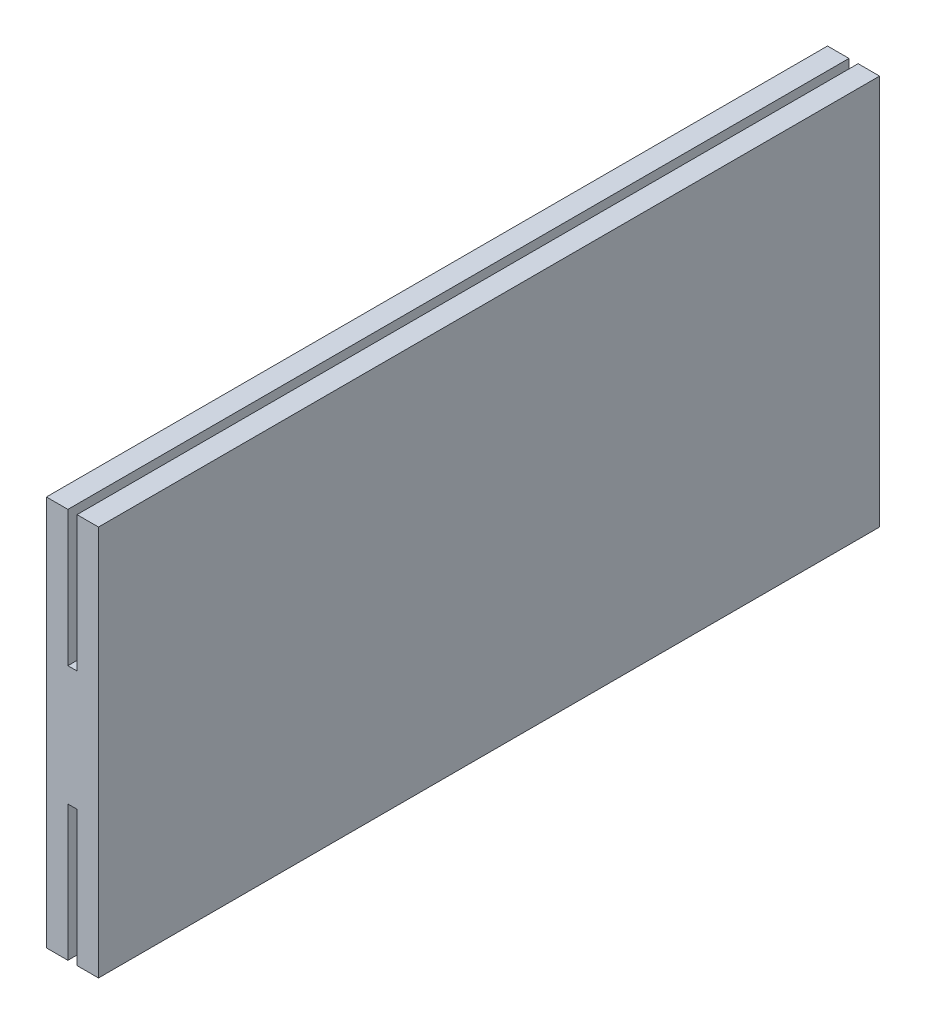
ISO-10303-21;
HEADER;
FILE_DESCRIPTION(('STEP AP214'),'2;1');
FILE_NAME('part.step','',(''),(''),'','','');
FILE_SCHEMA(('AUTOMOTIVE_DESIGN { 1 0 10303 214 1 1 1 1 }'));
ENDSEC;
DATA;
#1=APPLICATION_CONTEXT('core data for automotive mechanical design processes');
#2=APPLICATION_PROTOCOL_DEFINITION('international standard','automotive_design',2000,#1);
#3=PRODUCT_CONTEXT('',#1,'mechanical');
#4=PRODUCT('Part','Part','',(#3));
#5=PRODUCT_RELATED_PRODUCT_CATEGORY('part','',(#4));
#6=PRODUCT_DEFINITION_FORMATION('','',#4);
#7=PRODUCT_DEFINITION_CONTEXT('part definition',#1,'design');
#8=PRODUCT_DEFINITION('design','',#6,#7);
#9=PRODUCT_DEFINITION_SHAPE('','',#8);
#10=(LENGTH_UNIT() NAMED_UNIT(*) SI_UNIT(.MILLI.,.METRE.));
#11=(NAMED_UNIT(*) PLANE_ANGLE_UNIT() SI_UNIT($,.RADIAN.));
#12=(NAMED_UNIT(*) SI_UNIT($,.STERADIAN.) SOLID_ANGLE_UNIT());
#13=UNCERTAINTY_MEASURE_WITH_UNIT(LENGTH_MEASURE(1.E-05),#10,'distance_accuracy_value','');
#14=(GEOMETRIC_REPRESENTATION_CONTEXT(3) GLOBAL_UNCERTAINTY_ASSIGNED_CONTEXT((#13)) GLOBAL_UNIT_ASSIGNED_CONTEXT((#10,
#11,#12)) REPRESENTATION_CONTEXT('',''));
#15=CARTESIAN_POINT('',(0.,0.,0.));
#16=DIRECTION('',(0.,0.,1.));
#17=DIRECTION('',(1.,0.,0.));
#18=AXIS2_PLACEMENT_3D('',#15,#16,#17);
#19=CARTESIAN_POINT('',(0.,7.5,30.));
#20=DIRECTION('',(0.,1.,0.));
#21=DIRECTION('',(0.,0.,1.));
#22=AXIS2_PLACEMENT_3D('',#19,#20,#21);
#23=PLANE('',#22);
#24=DIRECTION('',(1.,0.,0.));
#25=VECTOR('',#24,1.);
#26=CARTESIAN_POINT('',(0.,7.5,0.));
#27=LINE('',#26,#25);
#28=CARTESIAN_POINT('',(0.174999999999999,7.5,0.));
#29=VERTEX_POINT('',#28);
#30=CARTESIAN_POINT('',(0.999999999999999,7.5,0.));
#31=VERTEX_POINT('',#30);
#32=EDGE_CURVE('E170',#29,#31,#27,.T.);
#33=ORIENTED_EDGE('',*,*,#32,.F.);
#34=DIRECTION('',(0.,0.,-1.));
#35=VECTOR('',#34,1.);
#36=CARTESIAN_POINT('',(0.174999999999999,7.5,30.));
#37=LINE('',#36,#35);
#38=CARTESIAN_POINT('',(0.174999999999999,7.5,30.));
#39=VERTEX_POINT('',#38);
#40=EDGE_CURVE('E11',#39,#29,#37,.T.);
#41=ORIENTED_EDGE('',*,*,#40,.F.);
#42=DIRECTION('',(1.,0.,0.));
#43=VECTOR('',#42,1.);
#44=CARTESIAN_POINT('',(0.,7.5,30.));
#45=LINE('',#44,#43);
#46=CARTESIAN_POINT('',(0.999999999999999,7.5,30.));
#47=VERTEX_POINT('',#46);
#48=EDGE_CURVE('E206',#39,#47,#45,.T.);
#49=ORIENTED_EDGE('',*,*,#48,.T.);
#50=DIRECTION('',(0.,0.,-1.));
#51=VECTOR('',#50,1.);
#52=CARTESIAN_POINT('',(0.999999999999999,7.5,30.));
#53=LINE('',#52,#51);
#54=EDGE_CURVE('E61',#47,#31,#53,.T.);
#55=ORIENTED_EDGE('',*,*,#54,.T.);
#56=EDGE_LOOP('',(#33,#41,#49,#55));
#57=FACE_BOUND('',#56,.T.);
#58=ADVANCED_FACE('F43',(#57),#23,.T.);
#59=CARTESIAN_POINT('',(0.175,0.,30.));
#60=DIRECTION('',(1.,0.,0.));
#61=DIRECTION('',(0.,1.,0.));
#62=AXIS2_PLACEMENT_3D('',#59,#60,#61);
#63=PLANE('',#62);
#64=DIRECTION('',(0.,-1.,0.));
#65=VECTOR('',#64,1.);
#66=CARTESIAN_POINT('',(0.175,0.,0.));
#67=LINE('',#66,#65);
#68=CARTESIAN_POINT('',(0.175,2.3,0.));
#69=VERTEX_POINT('',#68);
#70=EDGE_CURVE('E173',#29,#69,#67,.T.);
#71=ORIENTED_EDGE('',*,*,#70,.T.);
#72=DIRECTION('',(0.,0.,-1.));
#73=VECTOR('',#72,1.);
#74=CARTESIAN_POINT('',(0.175,2.3,30.));
#75=LINE('',#74,#73);
#76=CARTESIAN_POINT('',(0.175,2.3,30.));
#77=VERTEX_POINT('',#76);
#78=EDGE_CURVE('E53',#77,#69,#75,.T.);
#79=ORIENTED_EDGE('',*,*,#78,.F.);
#80=DIRECTION('',(0.,-1.,0.));
#81=VECTOR('',#80,1.);
#82=CARTESIAN_POINT('',(0.175,0.,30.));
#83=LINE('',#82,#81);
#84=EDGE_CURVE('E256',#39,#77,#83,.T.);
#85=ORIENTED_EDGE('',*,*,#84,.F.);
#86=ORIENTED_EDGE('',*,*,#40,.T.);
#87=EDGE_LOOP('',(#71,#79,#85,#86));
#88=FACE_BOUND('',#87,.T.);
#89=ADVANCED_FACE('F45',(#88),#63,.F.);
#90=CARTESIAN_POINT('',(0.,2.3,30.));
#91=DIRECTION('',(0.,1.,0.));
#92=DIRECTION('',(0.,0.,1.));
#93=AXIS2_PLACEMENT_3D('',#90,#91,#92);
#94=PLANE('',#93);
#95=DIRECTION('',(1.,0.,0.));
#96=VECTOR('',#95,1.);
#97=CARTESIAN_POINT('',(0.,2.3,0.));
#98=LINE('',#97,#96);
#99=CARTESIAN_POINT('',(-0.175,2.3,0.));
#100=VERTEX_POINT('',#99);
#101=EDGE_CURVE('E178',#100,#69,#98,.T.);
#102=ORIENTED_EDGE('',*,*,#101,.F.);
#103=DIRECTION('',(0.,0.,-1.));
#104=VECTOR('',#103,1.);
#105=CARTESIAN_POINT('',(-0.175,2.3,30.));
#106=LINE('',#105,#104);
#107=CARTESIAN_POINT('',(-0.175,2.3,30.));
#108=VERTEX_POINT('',#107);
#109=EDGE_CURVE('E231',#108,#100,#106,.T.);
#110=ORIENTED_EDGE('',*,*,#109,.F.);
#111=DIRECTION('',(1.,0.,0.));
#112=VECTOR('',#111,1.);
#113=CARTESIAN_POINT('',(0.,2.3,30.));
#114=LINE('',#113,#112);
#115=EDGE_CURVE('E240',#108,#77,#114,.T.);
#116=ORIENTED_EDGE('',*,*,#115,.T.);
#117=ORIENTED_EDGE('',*,*,#78,.T.);
#118=EDGE_LOOP('',(#102,#110,#116,#117));
#119=FACE_BOUND('',#118,.T.);
#120=ADVANCED_FACE('F238',(#119),#94,.T.);
#121=CARTESIAN_POINT('',(-0.175,0.,30.));
#122=DIRECTION('',(1.,0.,0.));
#123=DIRECTION('',(0.,1.,0.));
#124=AXIS2_PLACEMENT_3D('',#121,#122,#123);
#125=PLANE('',#124);
#126=DIRECTION('',(0.,-1.,0.));
#127=VECTOR('',#126,1.);
#128=CARTESIAN_POINT('',(-0.175,0.,0.));
#129=LINE('',#128,#127);
#130=CARTESIAN_POINT('',(-0.174999999999999,7.5,0.));
#131=VERTEX_POINT('',#130);
#132=EDGE_CURVE('E182',#131,#100,#129,.T.);
#133=ORIENTED_EDGE('',*,*,#132,.F.);
#134=DIRECTION('',(0.,0.,-1.));
#135=VECTOR('',#134,1.);
#136=CARTESIAN_POINT('',(-0.174999999999999,7.5,30.));
#137=LINE('',#136,#135);
#138=CARTESIAN_POINT('',(-0.174999999999999,7.5,30.));
#139=VERTEX_POINT('',#138);
#140=EDGE_CURVE('E228',#139,#131,#137,.T.);
#141=ORIENTED_EDGE('',*,*,#140,.F.);
#142=DIRECTION('',(0.,-1.,0.));
#143=VECTOR('',#142,1.);
#144=CARTESIAN_POINT('',(-0.175,0.,30.));
#145=LINE('',#144,#143);
#146=EDGE_CURVE('E253',#139,#108,#145,.T.);
#147=ORIENTED_EDGE('',*,*,#146,.T.);
#148=ORIENTED_EDGE('',*,*,#109,.T.);
#149=EDGE_LOOP('',(#133,#141,#147,#148));
#150=FACE_BOUND('',#149,.T.);
#151=ADVANCED_FACE('F250',(#150),#125,.T.);
#152=CARTESIAN_POINT('',(-1.,7.5,0.));
#153=VERTEX_POINT('',#152);
#154=EDGE_CURVE('E174',#153,#131,#27,.T.);
#155=ORIENTED_EDGE('',*,*,#154,.F.);
#156=DIRECTION('',(0.,0.,-1.));
#157=VECTOR('',#156,1.);
#158=CARTESIAN_POINT('',(-1.,7.5,30.));
#159=LINE('',#158,#157);
#160=CARTESIAN_POINT('',(-1.,7.5,30.));
#161=VERTEX_POINT('',#160);
#162=EDGE_CURVE('E225',#161,#153,#159,.T.);
#163=ORIENTED_EDGE('',*,*,#162,.F.);
#164=EDGE_CURVE('E261',#161,#139,#45,.T.);
#165=ORIENTED_EDGE('',*,*,#164,.T.);
#166=ORIENTED_EDGE('',*,*,#140,.T.);
#167=EDGE_LOOP('',(#155,#163,#165,#166));
#168=FACE_BOUND('',#167,.T.);
#169=ADVANCED_FACE('F285',(#168),#23,.T.);
#170=CARTESIAN_POINT('',(-1.,0.,30.));
#171=DIRECTION('',(1.,0.,0.));
#172=DIRECTION('',(0.,1.,0.));
#173=AXIS2_PLACEMENT_3D('',#170,#171,#172);
#174=PLANE('',#173);
#175=DIRECTION('',(0.,-1.,0.));
#176=VECTOR('',#175,1.);
#177=CARTESIAN_POINT('',(-1.,0.,0.));
#178=LINE('',#177,#176);
#179=CARTESIAN_POINT('',(-0.999999999999999,-7.5,0.));
#180=VERTEX_POINT('',#179);
#181=EDGE_CURVE('E186',#153,#180,#178,.T.);
#182=ORIENTED_EDGE('',*,*,#181,.T.);
#183=DIRECTION('',(0.,0.,-1.));
#184=VECTOR('',#183,1.);
#185=CARTESIAN_POINT('',(-0.999999999999999,-7.5,30.));
#186=LINE('',#185,#184);
#187=CARTESIAN_POINT('',(-0.999999999999999,-7.5,30.));
#188=VERTEX_POINT('',#187);
#189=EDGE_CURVE('E221',#188,#180,#186,.T.);
#190=ORIENTED_EDGE('',*,*,#189,.F.);
#191=DIRECTION('',(0.,-1.,0.));
#192=VECTOR('',#191,1.);
#193=CARTESIAN_POINT('',(-1.,0.,30.));
#194=LINE('',#193,#192);
#195=EDGE_CURVE('E266',#161,#188,#194,.T.);
#196=ORIENTED_EDGE('',*,*,#195,.F.);
#197=ORIENTED_EDGE('',*,*,#162,.T.);
#198=EDGE_LOOP('',(#182,#190,#196,#197));
#199=FACE_BOUND('',#198,.T.);
#200=ADVANCED_FACE('F289',(#199),#174,.F.);
#201=CARTESIAN_POINT('',(0.,-7.5,30.));
#202=DIRECTION('',(0.,1.,0.));
#203=DIRECTION('',(0.,0.,1.));
#204=AXIS2_PLACEMENT_3D('',#201,#202,#203);
#205=PLANE('',#204);
#206=DIRECTION('',(1.,0.,0.));
#207=VECTOR('',#206,1.);
#208=CARTESIAN_POINT('',(0.,-7.5,0.));
#209=LINE('',#208,#207);
#210=CARTESIAN_POINT('',(-0.175,-7.5,0.));
#211=VERTEX_POINT('',#210);
#212=EDGE_CURVE('E189',#180,#211,#209,.T.);
#213=ORIENTED_EDGE('',*,*,#212,.T.);
#214=DIRECTION('',(0.,0.,-1.));
#215=VECTOR('',#214,1.);
#216=CARTESIAN_POINT('',(-0.175,-7.5,30.));
#217=LINE('',#216,#215);
#218=CARTESIAN_POINT('',(-0.175,-7.5,30.));
#219=VERTEX_POINT('',#218);
#220=EDGE_CURVE('E217',#219,#211,#217,.T.);
#221=ORIENTED_EDGE('',*,*,#220,.F.);
#222=DIRECTION('',(1.,0.,0.));
#223=VECTOR('',#222,1.);
#224=CARTESIAN_POINT('',(0.,-7.5,30.));
#225=LINE('',#224,#223);
#226=EDGE_CURVE('E155',#188,#219,#225,.T.);
#227=ORIENTED_EDGE('',*,*,#226,.F.);
#228=ORIENTED_EDGE('',*,*,#189,.T.);
#229=EDGE_LOOP('',(#213,#221,#227,#228));
#230=FACE_BOUND('',#229,.T.);
#231=ADVANCED_FACE('F292',(#230),#205,.F.);
#232=CARTESIAN_POINT('',(-0.175,0.,30.));
#233=DIRECTION('',(-1.,0.,0.));
#234=DIRECTION('',(0.,0.,1.));
#235=AXIS2_PLACEMENT_3D('',#232,#233,#234);
#236=PLANE('',#235);
#237=DIRECTION('',(0.,1.,0.));
#238=VECTOR('',#237,1.);
#239=CARTESIAN_POINT('',(-0.175,0.,0.));
#240=LINE('',#239,#238);
#241=CARTESIAN_POINT('',(-0.175,-2.3,0.));
#242=VERTEX_POINT('',#241);
#243=EDGE_CURVE('E192',#211,#242,#240,.T.);
#244=ORIENTED_EDGE('',*,*,#243,.T.);
#245=DIRECTION('',(0.,0.,-1.));
#246=VECTOR('',#245,1.);
#247=CARTESIAN_POINT('',(-0.175,-2.3,30.));
#248=LINE('',#247,#246);
#249=CARTESIAN_POINT('',(-0.175,-2.3,30.));
#250=VERTEX_POINT('',#249);
#251=EDGE_CURVE('E213',#250,#242,#248,.T.);
#252=ORIENTED_EDGE('',*,*,#251,.F.);
#253=DIRECTION('',(0.,1.,0.));
#254=VECTOR('',#253,1.);
#255=CARTESIAN_POINT('',(-0.175,0.,30.));
#256=LINE('',#255,#254);
#257=EDGE_CURVE('E164',#219,#250,#256,.T.);
#258=ORIENTED_EDGE('',*,*,#257,.F.);
#259=ORIENTED_EDGE('',*,*,#220,.T.);
#260=EDGE_LOOP('',(#244,#252,#258,#259));
#261=FACE_BOUND('',#260,.T.);
#262=ADVANCED_FACE('F275',(#261),#236,.F.);
#263=CARTESIAN_POINT('',(0.,-2.3,30.));
#264=DIRECTION('',(0.,1.,0.));
#265=DIRECTION('',(0.,0.,1.));
#266=AXIS2_PLACEMENT_3D('',#263,#264,#265);
#267=PLANE('',#266);
#268=DIRECTION('',(1.,0.,0.));
#269=VECTOR('',#268,1.);
#270=CARTESIAN_POINT('',(0.,-2.3,0.));
#271=LINE('',#270,#269);
#272=CARTESIAN_POINT('',(0.175,-2.3,0.));
#273=VERTEX_POINT('',#272);
#274=EDGE_CURVE('E196',#242,#273,#271,.T.);
#275=ORIENTED_EDGE('',*,*,#274,.T.);
#276=DIRECTION('',(0.,0.,-1.));
#277=VECTOR('',#276,1.);
#278=CARTESIAN_POINT('',(0.175,-2.3,30.));
#279=LINE('',#278,#277);
#280=CARTESIAN_POINT('',(0.175,-2.3,30.));
#281=VERTEX_POINT('',#280);
#282=EDGE_CURVE('E146',#281,#273,#279,.T.);
#283=ORIENTED_EDGE('',*,*,#282,.F.);
#284=DIRECTION('',(1.,0.,0.));
#285=VECTOR('',#284,1.);
#286=CARTESIAN_POINT('',(0.,-2.3,30.));
#287=LINE('',#286,#285);
#288=EDGE_CURVE('E159',#250,#281,#287,.T.);
#289=ORIENTED_EDGE('',*,*,#288,.F.);
#290=ORIENTED_EDGE('',*,*,#251,.T.);
#291=EDGE_LOOP('',(#275,#283,#289,#290));
#292=FACE_BOUND('',#291,.T.);
#293=ADVANCED_FACE('F279',(#292),#267,.F.);
#294=CARTESIAN_POINT('',(0.175,0.,30.));
#295=DIRECTION('',(-1.,0.,0.));
#296=DIRECTION('',(0.,0.,1.));
#297=AXIS2_PLACEMENT_3D('',#294,#295,#296);
#298=PLANE('',#297);
#299=DIRECTION('',(0.,1.,0.));
#300=VECTOR('',#299,1.);
#301=CARTESIAN_POINT('',(0.175,0.,0.));
#302=LINE('',#301,#300);
#303=CARTESIAN_POINT('',(0.175,-7.5,0.));
#304=VERTEX_POINT('',#303);
#305=EDGE_CURVE('E142',#304,#273,#302,.T.);
#306=ORIENTED_EDGE('',*,*,#305,.F.);
#307=DIRECTION('',(0.,0.,-1.));
#308=VECTOR('',#307,1.);
#309=CARTESIAN_POINT('',(0.175,-7.5,30.));
#310=LINE('',#309,#308);
#311=CARTESIAN_POINT('',(0.175,-7.5,30.));
#312=VERTEX_POINT('',#311);
#313=EDGE_CURVE('E136',#312,#304,#310,.T.);
#314=ORIENTED_EDGE('',*,*,#313,.F.);
#315=DIRECTION('',(0.,1.,0.));
#316=VECTOR('',#315,1.);
#317=CARTESIAN_POINT('',(0.175,0.,30.));
#318=LINE('',#317,#316);
#319=EDGE_CURVE('E140',#312,#281,#318,.T.);
#320=ORIENTED_EDGE('',*,*,#319,.T.);
#321=ORIENTED_EDGE('',*,*,#282,.T.);
#322=EDGE_LOOP('',(#306,#314,#320,#321));
#323=FACE_BOUND('',#322,.T.);
#324=ADVANCED_FACE('F138',(#323),#298,.T.);
#325=CARTESIAN_POINT('',(1.,-7.5,0.));
#326=VERTEX_POINT('',#325);
#327=EDGE_CURVE('E193',#304,#326,#209,.T.);
#328=ORIENTED_EDGE('',*,*,#327,.T.);
#329=DIRECTION('',(0.,0.,-1.));
#330=VECTOR('',#329,1.);
#331=CARTESIAN_POINT('',(1.,-7.5,30.));
#332=LINE('',#331,#330);
#333=CARTESIAN_POINT('',(1.,-7.5,30.));
#334=VERTEX_POINT('',#333);
#335=EDGE_CURVE('E99',#334,#326,#332,.T.);
#336=ORIENTED_EDGE('',*,*,#335,.F.);
#337=EDGE_CURVE('E148',#312,#334,#225,.T.);
#338=ORIENTED_EDGE('',*,*,#337,.F.);
#339=ORIENTED_EDGE('',*,*,#313,.T.);
#340=EDGE_LOOP('',(#328,#336,#338,#339));
#341=FACE_BOUND('',#340,.T.);
#342=ADVANCED_FACE('F149',(#341),#205,.F.);
#343=CARTESIAN_POINT('',(1.,0.,30.));
#344=DIRECTION('',(1.,0.,0.));
#345=DIRECTION('',(0.,1.,0.));
#346=AXIS2_PLACEMENT_3D('',#343,#344,#345);
#347=PLANE('',#346);
#348=DIRECTION('',(0.,-1.,0.));
#349=VECTOR('',#348,1.);
#350=CARTESIAN_POINT('',(1.,0.,0.));
#351=LINE('',#350,#349);
#352=EDGE_CURVE('E202',#31,#326,#351,.T.);
#353=ORIENTED_EDGE('',*,*,#352,.F.);
#354=ORIENTED_EDGE('',*,*,#54,.F.);
#355=DIRECTION('',(0.,-1.,0.));
#356=VECTOR('',#355,1.);
#357=CARTESIAN_POINT('',(1.,0.,30.));
#358=LINE('',#357,#356);
#359=EDGE_CURVE('E153',#47,#334,#358,.T.);
#360=ORIENTED_EDGE('',*,*,#359,.T.);
#361=ORIENTED_EDGE('',*,*,#335,.T.);
#362=EDGE_LOOP('',(#353,#354,#360,#361));
#363=FACE_BOUND('',#362,.T.);
#364=ADVANCED_FACE('F304',(#363),#347,.T.);
#365=CARTESIAN_POINT('',(0.,0.,30.));
#366=DIRECTION('',(0.,0.,1.));
#367=DIRECTION('',(1.,0.,0.));
#368=AXIS2_PLACEMENT_3D('',#365,#366,#367);
#369=PLANE('',#368);
#370=ORIENTED_EDGE('',*,*,#48,.F.);
#371=ORIENTED_EDGE('',*,*,#84,.T.);
#372=ORIENTED_EDGE('',*,*,#115,.F.);
#373=ORIENTED_EDGE('',*,*,#146,.F.);
#374=ORIENTED_EDGE('',*,*,#164,.F.);
#375=ORIENTED_EDGE('',*,*,#195,.T.);
#376=ORIENTED_EDGE('',*,*,#226,.T.);
#377=ORIENTED_EDGE('',*,*,#257,.T.);
#378=ORIENTED_EDGE('',*,*,#288,.T.);
#379=ORIENTED_EDGE('',*,*,#319,.F.);
#380=ORIENTED_EDGE('',*,*,#337,.T.);
#381=ORIENTED_EDGE('',*,*,#359,.F.);
#382=EDGE_LOOP('',(#370,#371,#372,#373,#374,#375,#376,#377,#378,#379,#380,#381));
#383=FACE_BOUND('',#382,.T.);
#384=ADVANCED_FACE('F157',(#383),#369,.T.);
#385=CARTESIAN_POINT('',(0.,0.,0.));
#386=DIRECTION('',(0.,0.,1.));
#387=DIRECTION('',(1.,0.,0.));
#388=AXIS2_PLACEMENT_3D('',#385,#386,#387);
#389=PLANE('',#388);
#390=ORIENTED_EDGE('',*,*,#32,.T.);
#391=ORIENTED_EDGE('',*,*,#352,.T.);
#392=ORIENTED_EDGE('',*,*,#327,.F.);
#393=ORIENTED_EDGE('',*,*,#305,.T.);
#394=ORIENTED_EDGE('',*,*,#274,.F.);
#395=ORIENTED_EDGE('',*,*,#243,.F.);
#396=ORIENTED_EDGE('',*,*,#212,.F.);
#397=ORIENTED_EDGE('',*,*,#181,.F.);
#398=ORIENTED_EDGE('',*,*,#154,.T.);
#399=ORIENTED_EDGE('',*,*,#132,.T.);
#400=ORIENTED_EDGE('',*,*,#101,.T.);
#401=ORIENTED_EDGE('',*,*,#70,.F.);
#402=EDGE_LOOP('',(#390,#391,#392,#393,#394,#395,#396,#397,#398,#399,#400,#401));
#403=FACE_BOUND('',#402,.T.);
#404=ADVANCED_FACE('F244',(#403),#389,.F.);
#405=CLOSED_SHELL('',(#58,#89,#120,#151,#169,#200,#231,#262,#293,#324,#342,#364,#384,#404));
#406=MANIFOLD_SOLID_BREP('B2',#405);
#407=ADVANCED_BREP_SHAPE_REPRESENTATION('',(#18,#406),#14);
#408=SHAPE_DEFINITION_REPRESENTATION(#9,#407);
ENDSEC;
END-ISO-10303-21;
